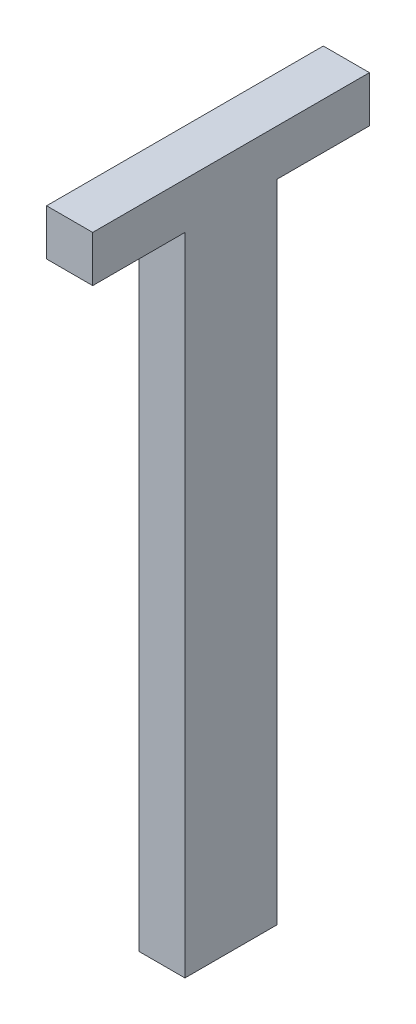
ISO-10303-21;
HEADER;
FILE_DESCRIPTION(('STEP AP214'),'2;1');
FILE_NAME('part.step','',(''),(''),'','','');
FILE_SCHEMA(('AUTOMOTIVE_DESIGN { 1 0 10303 214 1 1 1 1 }'));
ENDSEC;
DATA;
#1=APPLICATION_CONTEXT('core data for automotive mechanical design processes');
#2=APPLICATION_PROTOCOL_DEFINITION('international standard','automotive_design',2000,#1);
#3=PRODUCT_CONTEXT('',#1,'mechanical');
#4=PRODUCT('Part','Part','',(#3));
#5=PRODUCT_RELATED_PRODUCT_CATEGORY('part','',(#4));
#6=PRODUCT_DEFINITION_FORMATION('','',#4);
#7=PRODUCT_DEFINITION_CONTEXT('part definition',#1,'design');
#8=PRODUCT_DEFINITION('design','',#6,#7);
#9=PRODUCT_DEFINITION_SHAPE('','',#8);
#10=(LENGTH_UNIT() NAMED_UNIT(*) SI_UNIT(.MILLI.,.METRE.));
#11=(NAMED_UNIT(*) PLANE_ANGLE_UNIT() SI_UNIT($,.RADIAN.));
#12=(NAMED_UNIT(*) SI_UNIT($,.STERADIAN.) SOLID_ANGLE_UNIT());
#13=UNCERTAINTY_MEASURE_WITH_UNIT(LENGTH_MEASURE(1.E-05),#10,'distance_accuracy_value','');
#14=(GEOMETRIC_REPRESENTATION_CONTEXT(3) GLOBAL_UNCERTAINTY_ASSIGNED_CONTEXT((#13)) GLOBAL_UNIT_ASSIGNED_CONTEXT((#10,
#11,#12)) REPRESENTATION_CONTEXT('',''));
#15=CARTESIAN_POINT('',(0.,0.,0.));
#16=DIRECTION('',(0.,0.,1.));
#17=DIRECTION('',(1.,0.,0.));
#18=AXIS2_PLACEMENT_3D('',#15,#16,#17);
#19=CARTESIAN_POINT('',(0.,70.,0.));
#20=DIRECTION('',(1.,0.,0.));
#21=DIRECTION('',(0.,0.,-1.));
#22=AXIS2_PLACEMENT_3D('',#19,#20,#21);
#23=PLANE('',#22);
#24=DIRECTION('',(0.,0.,1.));
#25=VECTOR('',#24,1.);
#26=CARTESIAN_POINT('',(0.,0.,0.));
#27=LINE('',#26,#25);
#28=CARTESIAN_POINT('',(0.,0.,-9.99999999999999));
#29=VERTEX_POINT('',#28);
#30=CARTESIAN_POINT('',(0.,0.,0.));
#31=VERTEX_POINT('',#30);
#32=EDGE_CURVE('E117',#29,#31,#27,.T.);
#33=ORIENTED_EDGE('',*,*,#32,.T.);
#34=DIRECTION('',(0.,-1.,0.));
#35=VECTOR('',#34,1.);
#36=CARTESIAN_POINT('',(0.,70.,0.));
#37=LINE('',#36,#35);
#38=CARTESIAN_POINT('',(0.,70.,0.));
#39=VERTEX_POINT('',#38);
#40=EDGE_CURVE('E11',#39,#31,#37,.T.);
#41=ORIENTED_EDGE('',*,*,#40,.F.);
#42=DIRECTION('',(0.,0.,-1.));
#43=VECTOR('',#42,1.);
#44=CARTESIAN_POINT('',(0.,70.,0.));
#45=LINE('',#44,#43);
#46=CARTESIAN_POINT('',(0.,70.,10.));
#47=VERTEX_POINT('',#46);
#48=EDGE_CURVE('E114',#47,#39,#45,.T.);
#49=ORIENTED_EDGE('',*,*,#48,.F.);
#50=DIRECTION('',(0.,-1.,0.));
#51=VECTOR('',#50,1.);
#52=CARTESIAN_POINT('',(0.,75.,10.));
#53=LINE('',#52,#51);
#54=CARTESIAN_POINT('',(0.,75.,10.));
#55=VERTEX_POINT('',#54);
#56=EDGE_CURVE('E106',#55,#47,#53,.T.);
#57=ORIENTED_EDGE('',*,*,#56,.F.);
#58=DIRECTION('',(0.,0.,-1.));
#59=VECTOR('',#58,1.);
#60=CARTESIAN_POINT('',(0.,75.,0.));
#61=LINE('',#60,#59);
#62=CARTESIAN_POINT('',(0.,75.,-20.));
#63=VERTEX_POINT('',#62);
#64=EDGE_CURVE('E111',#55,#63,#61,.T.);
#65=ORIENTED_EDGE('',*,*,#64,.T.);
#66=DIRECTION('',(0.,-1.,0.));
#67=VECTOR('',#66,1.);
#68=CARTESIAN_POINT('',(0.,75.,-20.));
#69=LINE('',#68,#67);
#70=CARTESIAN_POINT('',(0.,70.,-20.));
#71=VERTEX_POINT('',#70);
#72=EDGE_CURVE('E139',#63,#71,#69,.T.);
#73=ORIENTED_EDGE('',*,*,#72,.T.);
#74=CARTESIAN_POINT('',(0.,70.,-9.99999999999999));
#75=VERTEX_POINT('',#74);
#76=EDGE_CURVE('E142',#75,#71,#45,.T.);
#77=ORIENTED_EDGE('',*,*,#76,.F.);
#78=DIRECTION('',(0.,-1.,0.));
#79=VECTOR('',#78,1.);
#80=CARTESIAN_POINT('',(0.,70.,-9.99999999999999));
#81=LINE('',#80,#79);
#82=EDGE_CURVE('E156',#75,#29,#81,.T.);
#83=ORIENTED_EDGE('',*,*,#82,.T.);
#84=EDGE_LOOP('',(#33,#41,#49,#57,#65,#73,#77,#83));
#85=FACE_BOUND('',#84,.T.);
#86=ADVANCED_FACE('F35',(#85),#23,.F.);
#87=CARTESIAN_POINT('',(0.,70.,0.));
#88=DIRECTION('',(0.,0.,-1.));
#89=DIRECTION('',(-1.,0.,0.));
#90=AXIS2_PLACEMENT_3D('',#87,#88,#89);
#91=PLANE('',#90);
#92=DIRECTION('',(1.,0.,0.));
#93=VECTOR('',#92,1.);
#94=CARTESIAN_POINT('',(0.,0.,0.));
#95=LINE('',#94,#93);
#96=CARTESIAN_POINT('',(5.,0.,0.));
#97=VERTEX_POINT('',#96);
#98=EDGE_CURVE('E158',#31,#97,#95,.T.);
#99=ORIENTED_EDGE('',*,*,#98,.T.);
#100=DIRECTION('',(0.,-1.,0.));
#101=VECTOR('',#100,1.);
#102=CARTESIAN_POINT('',(5.,70.,0.));
#103=LINE('',#102,#101);
#104=CARTESIAN_POINT('',(5.,70.,0.));
#105=VERTEX_POINT('',#104);
#106=EDGE_CURVE('E43',#105,#97,#103,.T.);
#107=ORIENTED_EDGE('',*,*,#106,.F.);
#108=DIRECTION('',(1.,0.,0.));
#109=VECTOR('',#108,1.);
#110=CARTESIAN_POINT('',(0.,70.,0.));
#111=LINE('',#110,#109);
#112=EDGE_CURVE('E77',#39,#105,#111,.T.);
#113=ORIENTED_EDGE('',*,*,#112,.F.);
#114=ORIENTED_EDGE('',*,*,#40,.T.);
#115=EDGE_LOOP('',(#99,#107,#113,#114));
#116=FACE_BOUND('',#115,.T.);
#117=ADVANCED_FACE('F187',(#116),#91,.F.);
#118=CARTESIAN_POINT('',(5.,70.,0.));
#119=DIRECTION('',(-1.,0.,0.));
#120=DIRECTION('',(0.,0.,1.));
#121=AXIS2_PLACEMENT_3D('',#118,#119,#120);
#122=PLANE('',#121);
#123=DIRECTION('',(0.,0.,-1.));
#124=VECTOR('',#123,1.);
#125=CARTESIAN_POINT('',(5.,0.,0.));
#126=LINE('',#125,#124);
#127=CARTESIAN_POINT('',(5.,0.,-9.99999999999999));
#128=VERTEX_POINT('',#127);
#129=EDGE_CURVE('E67',#97,#128,#126,.T.);
#130=ORIENTED_EDGE('',*,*,#129,.T.);
#131=DIRECTION('',(0.,-1.,0.));
#132=VECTOR('',#131,1.);
#133=CARTESIAN_POINT('',(5.,70.,-9.99999999999999));
#134=LINE('',#133,#132);
#135=CARTESIAN_POINT('',(5.,70.,-9.99999999999999));
#136=VERTEX_POINT('',#135);
#137=EDGE_CURVE('E51',#136,#128,#134,.T.);
#138=ORIENTED_EDGE('',*,*,#137,.F.);
#139=DIRECTION('',(0.,0.,-1.));
#140=VECTOR('',#139,1.);
#141=CARTESIAN_POINT('',(5.,70.,0.));
#142=LINE('',#141,#140);
#143=CARTESIAN_POINT('',(5.,70.,-20.));
#144=VERTEX_POINT('',#143);
#145=EDGE_CURVE('E144',#136,#144,#142,.T.);
#146=ORIENTED_EDGE('',*,*,#145,.T.);
#147=DIRECTION('',(0.,-1.,0.));
#148=VECTOR('',#147,1.);
#149=CARTESIAN_POINT('',(5.,75.,-20.));
#150=LINE('',#149,#148);
#151=CARTESIAN_POINT('',(5.,75.,-20.));
#152=VERTEX_POINT('',#151);
#153=EDGE_CURVE('E148',#152,#144,#150,.T.);
#154=ORIENTED_EDGE('',*,*,#153,.F.);
#155=DIRECTION('',(0.,0.,-1.));
#156=VECTOR('',#155,1.);
#157=CARTESIAN_POINT('',(5.,75.,0.));
#158=LINE('',#157,#156);
#159=CARTESIAN_POINT('',(5.,75.,10.));
#160=VERTEX_POINT('',#159);
#161=EDGE_CURVE('E126',#160,#152,#158,.T.);
#162=ORIENTED_EDGE('',*,*,#161,.F.);
#163=DIRECTION('',(0.,-1.,0.));
#164=VECTOR('',#163,1.);
#165=CARTESIAN_POINT('',(5.,75.,10.));
#166=LINE('',#165,#164);
#167=CARTESIAN_POINT('',(5.,70.,10.));
#168=VERTEX_POINT('',#167);
#169=EDGE_CURVE('E118',#160,#168,#166,.T.);
#170=ORIENTED_EDGE('',*,*,#169,.T.);
#171=EDGE_CURVE('E134',#168,#105,#142,.T.);
#172=ORIENTED_EDGE('',*,*,#171,.T.);
#173=ORIENTED_EDGE('',*,*,#106,.T.);
#174=EDGE_LOOP('',(#130,#138,#146,#154,#162,#170,#172,#173));
#175=FACE_BOUND('',#174,.T.);
#176=ADVANCED_FACE('F163',(#175),#122,.F.);
#177=CARTESIAN_POINT('',(0.,70.,-9.99999999999999));
#178=DIRECTION('',(0.,0.,1.));
#179=DIRECTION('',(1.,0.,0.));
#180=AXIS2_PLACEMENT_3D('',#177,#178,#179);
#181=PLANE('',#180);
#182=DIRECTION('',(-1.,0.,0.));
#183=VECTOR('',#182,1.);
#184=CARTESIAN_POINT('',(0.,0.,-9.99999999999999));
#185=LINE('',#184,#183);
#186=EDGE_CURVE('E72',#128,#29,#185,.T.);
#187=ORIENTED_EDGE('',*,*,#186,.T.);
#188=ORIENTED_EDGE('',*,*,#82,.F.);
#189=DIRECTION('',(-1.,0.,0.));
#190=VECTOR('',#189,1.);
#191=CARTESIAN_POINT('',(0.,70.,-9.99999999999999));
#192=LINE('',#191,#190);
#193=EDGE_CURVE('E153',#136,#75,#192,.T.);
#194=ORIENTED_EDGE('',*,*,#193,.F.);
#195=ORIENTED_EDGE('',*,*,#137,.T.);
#196=EDGE_LOOP('',(#187,#188,#194,#195));
#197=FACE_BOUND('',#196,.T.);
#198=ADVANCED_FACE('F169',(#197),#181,.F.);
#199=CARTESIAN_POINT('',(0.,0.,0.));
#200=DIRECTION('',(0.,-1.,0.));
#201=DIRECTION('',(0.,0.,-1.));
#202=AXIS2_PLACEMENT_3D('',#199,#200,#201);
#203=PLANE('',#202);
#204=ORIENTED_EDGE('',*,*,#32,.F.);
#205=ORIENTED_EDGE('',*,*,#186,.F.);
#206=ORIENTED_EDGE('',*,*,#129,.F.);
#207=ORIENTED_EDGE('',*,*,#98,.F.);
#208=EDGE_LOOP('',(#204,#205,#206,#207));
#209=FACE_BOUND('',#208,.T.);
#210=ADVANCED_FACE('F167',(#209),#203,.T.);
#211=CARTESIAN_POINT('',(0.,70.,0.));
#212=DIRECTION('',(0.,1.,0.));
#213=DIRECTION('',(0.,0.,1.));
#214=AXIS2_PLACEMENT_3D('',#211,#212,#213);
#215=PLANE('',#214);
#216=ORIENTED_EDGE('',*,*,#48,.T.);
#217=ORIENTED_EDGE('',*,*,#112,.T.);
#218=ORIENTED_EDGE('',*,*,#171,.F.);
#219=DIRECTION('',(1.,0.,0.));
#220=VECTOR('',#219,1.);
#221=CARTESIAN_POINT('',(0.,70.,10.));
#222=LINE('',#221,#220);
#223=EDGE_CURVE('E141',#47,#168,#222,.T.);
#224=ORIENTED_EDGE('',*,*,#223,.F.);
#225=EDGE_LOOP('',(#216,#217,#218,#224));
#226=FACE_BOUND('',#225,.T.);
#227=ADVANCED_FACE('F199',(#226),#215,.F.);
#228=ORIENTED_EDGE('',*,*,#145,.F.);
#229=ORIENTED_EDGE('',*,*,#193,.T.);
#230=ORIENTED_EDGE('',*,*,#76,.T.);
#231=DIRECTION('',(1.,0.,0.));
#232=VECTOR('',#231,1.);
#233=CARTESIAN_POINT('',(0.,70.,-20.));
#234=LINE('',#233,#232);
#235=EDGE_CURVE('E131',#71,#144,#234,.T.);
#236=ORIENTED_EDGE('',*,*,#235,.T.);
#237=EDGE_LOOP('',(#228,#229,#230,#236));
#238=FACE_BOUND('',#237,.T.);
#239=ADVANCED_FACE('F172',(#238),#215,.F.);
#240=CARTESIAN_POINT('',(0.,75.,10.));
#241=DIRECTION('',(0.,0.,-1.));
#242=DIRECTION('',(-1.,0.,0.));
#243=AXIS2_PLACEMENT_3D('',#240,#241,#242);
#244=PLANE('',#243);
#245=ORIENTED_EDGE('',*,*,#223,.T.);
#246=ORIENTED_EDGE('',*,*,#169,.F.);
#247=DIRECTION('',(1.,0.,0.));
#248=VECTOR('',#247,1.);
#249=CARTESIAN_POINT('',(0.,75.,10.));
#250=LINE('',#249,#248);
#251=EDGE_CURVE('E121',#55,#160,#250,.T.);
#252=ORIENTED_EDGE('',*,*,#251,.F.);
#253=ORIENTED_EDGE('',*,*,#56,.T.);
#254=EDGE_LOOP('',(#245,#246,#252,#253));
#255=FACE_BOUND('',#254,.T.);
#256=ADVANCED_FACE('F122',(#255),#244,.F.);
#257=CARTESIAN_POINT('',(0.,75.,-20.));
#258=DIRECTION('',(0.,0.,-1.));
#259=DIRECTION('',(-1.,0.,0.));
#260=AXIS2_PLACEMENT_3D('',#257,#258,#259);
#261=PLANE('',#260);
#262=ORIENTED_EDGE('',*,*,#235,.F.);
#263=ORIENTED_EDGE('',*,*,#72,.F.);
#264=DIRECTION('',(1.,0.,0.));
#265=VECTOR('',#264,1.);
#266=CARTESIAN_POINT('',(0.,75.,-20.));
#267=LINE('',#266,#265);
#268=EDGE_CURVE('E130',#63,#152,#267,.T.);
#269=ORIENTED_EDGE('',*,*,#268,.T.);
#270=ORIENTED_EDGE('',*,*,#153,.T.);
#271=EDGE_LOOP('',(#262,#263,#269,#270));
#272=FACE_BOUND('',#271,.T.);
#273=ADVANCED_FACE('F176',(#272),#261,.T.);
#274=CARTESIAN_POINT('',(0.,75.,0.));
#275=DIRECTION('',(0.,1.,0.));
#276=DIRECTION('',(0.,0.,1.));
#277=AXIS2_PLACEMENT_3D('',#274,#275,#276);
#278=PLANE('',#277);
#279=ORIENTED_EDGE('',*,*,#64,.F.);
#280=ORIENTED_EDGE('',*,*,#251,.T.);
#281=ORIENTED_EDGE('',*,*,#161,.T.);
#282=ORIENTED_EDGE('',*,*,#268,.F.);
#283=EDGE_LOOP('',(#279,#280,#281,#282));
#284=FACE_BOUND('',#283,.T.);
#285=ADVANCED_FACE('F128',(#284),#278,.T.);
#286=CLOSED_SHELL('',(#86,#117,#176,#198,#210,#227,#239,#256,#273,#285));
#287=MANIFOLD_SOLID_BREP('B2',#286);
#288=ADVANCED_BREP_SHAPE_REPRESENTATION('',(#18,#287),#14);
#289=SHAPE_DEFINITION_REPRESENTATION(#9,#288);
ENDSEC;
END-ISO-10303-21;
